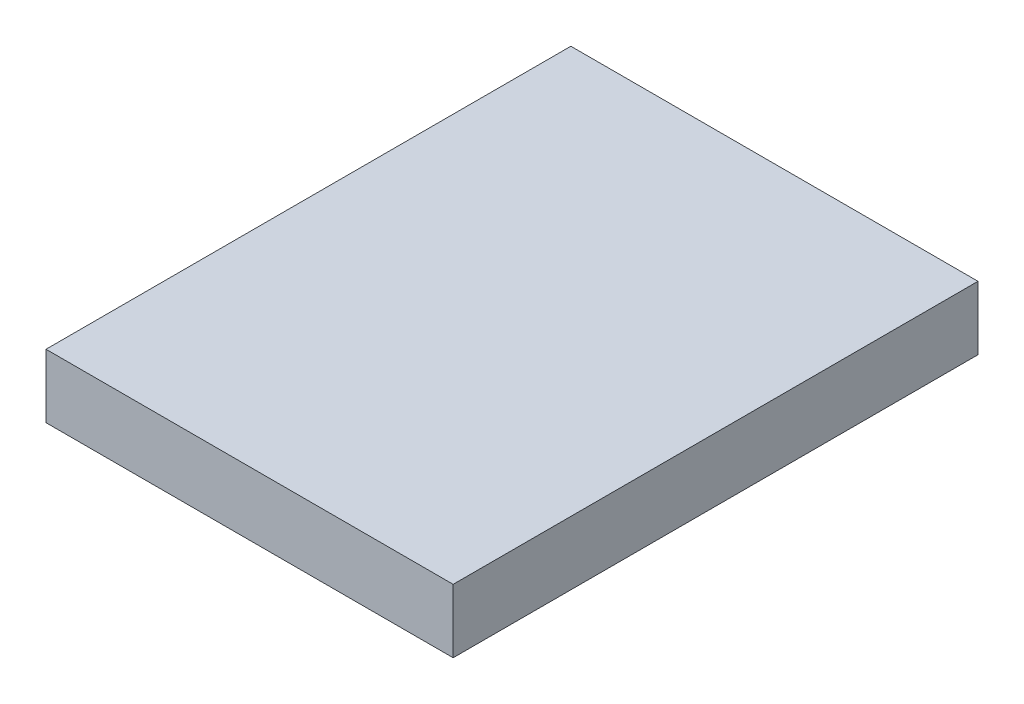
ISO-10303-21;
HEADER;
FILE_DESCRIPTION(('STEP AP214'),'2;1');
FILE_NAME('part.step','',(''),(''),'','','');
FILE_SCHEMA(('AUTOMOTIVE_DESIGN { 1 0 10303 214 1 1 1 1 }'));
ENDSEC;
DATA;
#1=APPLICATION_CONTEXT('core data for automotive mechanical design processes');
#2=APPLICATION_PROTOCOL_DEFINITION('international standard','automotive_design',2000,#1);
#3=PRODUCT_CONTEXT('',#1,'mechanical');
#4=PRODUCT('Part','Part','',(#3));
#5=PRODUCT_RELATED_PRODUCT_CATEGORY('part','',(#4));
#6=PRODUCT_DEFINITION_FORMATION('','',#4);
#7=PRODUCT_DEFINITION_CONTEXT('part definition',#1,'design');
#8=PRODUCT_DEFINITION('design','',#6,#7);
#9=PRODUCT_DEFINITION_SHAPE('','',#8);
#10=(LENGTH_UNIT() NAMED_UNIT(*) SI_UNIT(.MILLI.,.METRE.));
#11=(NAMED_UNIT(*) PLANE_ANGLE_UNIT() SI_UNIT($,.RADIAN.));
#12=(NAMED_UNIT(*) SI_UNIT($,.STERADIAN.) SOLID_ANGLE_UNIT());
#13=UNCERTAINTY_MEASURE_WITH_UNIT(LENGTH_MEASURE(1.E-05),#10,'distance_accuracy_value','');
#14=(GEOMETRIC_REPRESENTATION_CONTEXT(3) GLOBAL_UNCERTAINTY_ASSIGNED_CONTEXT((#13)) GLOBAL_UNIT_ASSIGNED_CONTEXT((#10,
#11,#12)) REPRESENTATION_CONTEXT('',''));
#15=CARTESIAN_POINT('',(0.,0.,0.));
#16=DIRECTION('',(0.,0.,1.));
#17=DIRECTION('',(1.,0.,0.));
#18=AXIS2_PLACEMENT_3D('',#15,#16,#17);
#19=CARTESIAN_POINT('',(-17.2667357512953,5.08,-7.79108808290155));
#20=DIRECTION('',(1.,0.,0.));
#21=DIRECTION('',(0.,0.,-1.));
#22=AXIS2_PLACEMENT_3D('',#19,#20,#21);
#23=PLANE('',#22);
#24=DIRECTION('',(0.,0.,1.));
#25=VECTOR('',#24,1.);
#26=CARTESIAN_POINT('',(-17.2667357512953,0.,-7.79108808290155));
#27=LINE('',#26,#25);
#28=CARTESIAN_POINT('',(-17.2667357512953,0.,-7.79108808290155));
#29=VERTEX_POINT('',#28);
#30=CARTESIAN_POINT('',(-17.2667357512953,0.,34.1189119170984));
#31=VERTEX_POINT('',#30);
#32=EDGE_CURVE('E109',#29,#31,#27,.T.);
#33=ORIENTED_EDGE('',*,*,#32,.T.);
#34=DIRECTION('',(0.,-1.,0.));
#35=VECTOR('',#34,1.);
#36=CARTESIAN_POINT('',(-17.2667357512953,5.08,34.1189119170984));
#37=LINE('',#36,#35);
#38=CARTESIAN_POINT('',(-17.2667357512953,5.08,34.1189119170984));
#39=VERTEX_POINT('',#38);
#40=EDGE_CURVE('E11',#39,#31,#37,.T.);
#41=ORIENTED_EDGE('',*,*,#40,.F.);
#42=DIRECTION('',(0.,0.,1.));
#43=VECTOR('',#42,1.);
#44=CARTESIAN_POINT('',(-17.2667357512953,5.08,-7.79108808290155));
#45=LINE('',#44,#43);
#46=CARTESIAN_POINT('',(-17.2667357512953,5.08,-7.79108808290155));
#47=VERTEX_POINT('',#46);
#48=EDGE_CURVE('E110',#47,#39,#45,.T.);
#49=ORIENTED_EDGE('',*,*,#48,.F.);
#50=DIRECTION('',(0.,-1.,0.));
#51=VECTOR('',#50,1.);
#52=CARTESIAN_POINT('',(-17.2667357512953,5.08,-7.79108808290155));
#53=LINE('',#52,#51);
#54=EDGE_CURVE('E116',#47,#29,#53,.T.);
#55=ORIENTED_EDGE('',*,*,#54,.T.);
#56=EDGE_LOOP('',(#33,#41,#49,#55));
#57=FACE_BOUND('',#56,.T.);
#58=ADVANCED_FACE('F34',(#57),#23,.F.);
#59=CARTESIAN_POINT('',(-17.2667357512953,5.08,34.1189119170984));
#60=DIRECTION('',(0.,0.,-1.));
#61=DIRECTION('',(-1.,0.,0.));
#62=AXIS2_PLACEMENT_3D('',#59,#60,#61);
#63=PLANE('',#62);
#64=DIRECTION('',(1.,0.,0.));
#65=VECTOR('',#64,1.);
#66=CARTESIAN_POINT('',(-17.2667357512953,0.,34.1189119170984));
#67=LINE('',#66,#65);
#68=CARTESIAN_POINT('',(15.2452642487047,0.,34.1189119170984));
#69=VERTEX_POINT('',#68);
#70=EDGE_CURVE('E119',#31,#69,#67,.T.);
#71=ORIENTED_EDGE('',*,*,#70,.T.);
#72=DIRECTION('',(0.,-1.,0.));
#73=VECTOR('',#72,1.);
#74=CARTESIAN_POINT('',(15.2452642487047,5.08,34.1189119170984));
#75=LINE('',#74,#73);
#76=CARTESIAN_POINT('',(15.2452642487047,5.08,34.1189119170984));
#77=VERTEX_POINT('',#76);
#78=EDGE_CURVE('E42',#77,#69,#75,.T.);
#79=ORIENTED_EDGE('',*,*,#78,.F.);
#80=DIRECTION('',(1.,0.,0.));
#81=VECTOR('',#80,1.);
#82=CARTESIAN_POINT('',(-17.2667357512953,5.08,34.1189119170984));
#83=LINE('',#82,#81);
#84=EDGE_CURVE('E81',#39,#77,#83,.T.);
#85=ORIENTED_EDGE('',*,*,#84,.F.);
#86=ORIENTED_EDGE('',*,*,#40,.T.);
#87=EDGE_LOOP('',(#71,#79,#85,#86));
#88=FACE_BOUND('',#87,.T.);
#89=ADVANCED_FACE('F143',(#88),#63,.F.);
#90=CARTESIAN_POINT('',(15.2452642487047,5.08,-7.79108808290155));
#91=DIRECTION('',(-1.,0.,0.));
#92=DIRECTION('',(0.,0.,1.));
#93=AXIS2_PLACEMENT_3D('',#90,#91,#92);
#94=PLANE('',#93);
#95=DIRECTION('',(0.,0.,-1.));
#96=VECTOR('',#95,1.);
#97=CARTESIAN_POINT('',(15.2452642487047,0.,-7.79108808290155));
#98=LINE('',#97,#96);
#99=CARTESIAN_POINT('',(15.2452642487047,0.,-7.79108808290155));
#100=VERTEX_POINT('',#99);
#101=EDGE_CURVE('E68',#69,#100,#98,.T.);
#102=ORIENTED_EDGE('',*,*,#101,.T.);
#103=DIRECTION('',(0.,-1.,0.));
#104=VECTOR('',#103,1.);
#105=CARTESIAN_POINT('',(15.2452642487047,5.08,-7.79108808290155));
#106=LINE('',#105,#104);
#107=CARTESIAN_POINT('',(15.2452642487047,5.08,-7.79108808290155));
#108=VERTEX_POINT('',#107);
#109=EDGE_CURVE('E124',#108,#100,#106,.T.);
#110=ORIENTED_EDGE('',*,*,#109,.F.);
#111=DIRECTION('',(0.,0.,-1.));
#112=VECTOR('',#111,1.);
#113=CARTESIAN_POINT('',(15.2452642487047,5.08,-7.79108808290155));
#114=LINE('',#113,#112);
#115=EDGE_CURVE('E113',#77,#108,#114,.T.);
#116=ORIENTED_EDGE('',*,*,#115,.F.);
#117=ORIENTED_EDGE('',*,*,#78,.T.);
#118=EDGE_LOOP('',(#102,#110,#116,#117));
#119=FACE_BOUND('',#118,.T.);
#120=ADVANCED_FACE('F126',(#119),#94,.F.);
#121=CARTESIAN_POINT('',(-17.2667357512953,5.08,-7.79108808290155));
#122=DIRECTION('',(0.,0.,1.));
#123=DIRECTION('',(1.,0.,0.));
#124=AXIS2_PLACEMENT_3D('',#121,#122,#123);
#125=PLANE('',#124);
#126=CARTESIAN_POINT('',(-12.1867357512953,2.71835312290647,-7.79108808290155));
#127=DIRECTION('',(0.,0.,-1.));
#128=DIRECTION('',(-1.,0.,0.));
#129=AXIS2_PLACEMENT_3D('',#126,#127,#128);
#130=CIRCLE('',#129,1.18744999999999);
#131=CARTESIAN_POINT('',(-13.3741857512953,2.71835312290647,-7.79108808290155));
#132=VERTEX_POINT('',#131);
#133=EDGE_CURVE('E99',#132,#132,#130,.T.);
#134=ORIENTED_EDGE('',*,*,#133,.F.);
#135=EDGE_LOOP('',(#134));
#136=FACE_BOUND('',#135,.T.);
#137=CARTESIAN_POINT('',(10.6732642487047,2.71835312290647,-7.79108808290155));
#138=DIRECTION('',(0.,0.,-1.));
#139=DIRECTION('',(-1.,0.,0.));
#140=AXIS2_PLACEMENT_3D('',#137,#138,#139);
#141=CIRCLE('',#140,1.18744999999999);
#142=CARTESIAN_POINT('',(9.48581424870467,2.71835312290647,-7.79108808290155));
#143=VERTEX_POINT('',#142);
#144=EDGE_CURVE('E98',#143,#143,#141,.T.);
#145=ORIENTED_EDGE('',*,*,#144,.F.);
#146=EDGE_LOOP('',(#145));
#147=FACE_BOUND('',#146,.T.);
#148=DIRECTION('',(-1.,0.,0.));
#149=VECTOR('',#148,1.);
#150=CARTESIAN_POINT('',(-17.2667357512953,0.,-7.79108808290155));
#151=LINE('',#150,#149);
#152=EDGE_CURVE('E74',#100,#29,#151,.T.);
#153=ORIENTED_EDGE('',*,*,#152,.T.);
#154=ORIENTED_EDGE('',*,*,#54,.F.);
#155=DIRECTION('',(-1.,0.,0.));
#156=VECTOR('',#155,1.);
#157=CARTESIAN_POINT('',(-17.2667357512953,5.08,-7.79108808290155));
#158=LINE('',#157,#156);
#159=EDGE_CURVE('E50',#108,#47,#158,.T.);
#160=ORIENTED_EDGE('',*,*,#159,.F.);
#161=ORIENTED_EDGE('',*,*,#109,.T.);
#162=EDGE_LOOP('',(#153,#154,#160,#161));
#163=FACE_BOUND('',#162,.T.);
#164=ADVANCED_FACE('F133',(#136,#147,#163),#125,.F.);
#165=CARTESIAN_POINT('',(0.,5.08,0.));
#166=DIRECTION('',(0.,1.,0.));
#167=DIRECTION('',(0.,0.,1.));
#168=AXIS2_PLACEMENT_3D('',#165,#166,#167);
#169=PLANE('',#168);
#170=ORIENTED_EDGE('',*,*,#48,.T.);
#171=ORIENTED_EDGE('',*,*,#84,.T.);
#172=ORIENTED_EDGE('',*,*,#115,.T.);
#173=ORIENTED_EDGE('',*,*,#159,.T.);
#174=EDGE_LOOP('',(#170,#171,#172,#173));
#175=FACE_BOUND('',#174,.T.);
#176=ADVANCED_FACE('F135',(#175),#169,.T.);
#177=CARTESIAN_POINT('',(0.,0.,0.));
#178=DIRECTION('',(0.,1.,0.));
#179=DIRECTION('',(0.,0.,1.));
#180=AXIS2_PLACEMENT_3D('',#177,#178,#179);
#181=PLANE('',#180);
#182=ORIENTED_EDGE('',*,*,#32,.F.);
#183=ORIENTED_EDGE('',*,*,#152,.F.);
#184=ORIENTED_EDGE('',*,*,#101,.F.);
#185=ORIENTED_EDGE('',*,*,#70,.F.);
#186=EDGE_LOOP('',(#182,#183,#184,#185));
#187=FACE_BOUND('',#186,.T.);
#188=ADVANCED_FACE('F129',(#187),#181,.F.);
#189=CARTESIAN_POINT('',(10.6732642487047,2.71835312290647,2.36891191709845));
#190=DIRECTION('',(0.,0.,-1.));
#191=DIRECTION('',(-1.,0.,0.));
#192=AXIS2_PLACEMENT_3D('',#189,#190,#191);
#193=CONICAL_SURFACE('',#192,1.18744999999999,1.02974425867665);
#194=CARTESIAN_POINT('',(10.6732642487047,2.71835312290647,3.08240385916272));
#195=VERTEX_POINT('',#194);
#196=VERTEX_LOOP('',#195);
#197=FACE_BOUND('',#196,.T.);
#198=CARTESIAN_POINT('',(10.6732642487047,2.71835312290647,2.36891191709845));
#199=DIRECTION('',(0.,0.,-1.));
#200=DIRECTION('',(-1.,0.,0.));
#201=AXIS2_PLACEMENT_3D('',#198,#199,#200);
#202=CIRCLE('',#201,1.18744999999999);
#203=CARTESIAN_POINT('',(9.48581424870468,2.71835312290647,2.36891191709845));
#204=VERTEX_POINT('',#203);
#205=EDGE_CURVE('E102',#204,#204,#202,.T.);
#206=ORIENTED_EDGE('',*,*,#205,.T.);
#207=EDGE_LOOP('',(#206));
#208=FACE_BOUND('',#207,.T.);
#209=ADVANCED_FACE('F173',(#197,#208),#193,.F.);
#210=CARTESIAN_POINT('',(10.6732642487047,2.71835312290647,-7.79108808290155));
#211=DIRECTION('',(0.,0.,-1.));
#212=DIRECTION('',(-1.,0.,0.));
#213=AXIS2_PLACEMENT_3D('',#210,#211,#212);
#214=CYLINDRICAL_SURFACE('',#213,1.18744999999999);
#215=ORIENTED_EDGE('',*,*,#205,.F.);
#216=EDGE_LOOP('',(#215));
#217=FACE_BOUND('',#216,.T.);
#218=ORIENTED_EDGE('',*,*,#144,.T.);
#219=EDGE_LOOP('',(#218));
#220=FACE_BOUND('',#219,.T.);
#221=ADVANCED_FACE('F92',(#217,#220),#214,.F.);
#222=CARTESIAN_POINT('',(-12.1867357512953,2.71835312290647,2.36891191709845));
#223=DIRECTION('',(0.,0.,-1.));
#224=DIRECTION('',(-1.,0.,0.));
#225=AXIS2_PLACEMENT_3D('',#222,#223,#224);
#226=CONICAL_SURFACE('',#225,1.18744999999999,1.02974425867665);
#227=CARTESIAN_POINT('',(-12.1867357512953,2.71835312290647,3.08240385916272));
#228=VERTEX_POINT('',#227);
#229=VERTEX_LOOP('',#228);
#230=FACE_BOUND('',#229,.T.);
#231=CARTESIAN_POINT('',(-12.1867357512953,2.71835312290647,2.36891191709845));
#232=DIRECTION('',(0.,0.,-1.));
#233=DIRECTION('',(-1.,0.,0.));
#234=AXIS2_PLACEMENT_3D('',#231,#232,#233);
#235=CIRCLE('',#234,1.18744999999999);
#236=CARTESIAN_POINT('',(-13.3741857512953,2.71835312290647,2.36891191709845));
#237=VERTEX_POINT('',#236);
#238=EDGE_CURVE('E96',#237,#237,#235,.T.);
#239=ORIENTED_EDGE('',*,*,#238,.T.);
#240=EDGE_LOOP('',(#239));
#241=FACE_BOUND('',#240,.T.);
#242=ADVANCED_FACE('F88',(#230,#241),#226,.F.);
#243=CARTESIAN_POINT('',(-12.1867357512953,2.71835312290647,-7.79108808290155));
#244=DIRECTION('',(0.,0.,-1.));
#245=DIRECTION('',(-1.,0.,0.));
#246=AXIS2_PLACEMENT_3D('',#243,#244,#245);
#247=CYLINDRICAL_SURFACE('',#246,1.18744999999999);
#248=ORIENTED_EDGE('',*,*,#238,.F.);
#249=EDGE_LOOP('',(#248));
#250=FACE_BOUND('',#249,.T.);
#251=ORIENTED_EDGE('',*,*,#133,.T.);
#252=EDGE_LOOP('',(#251));
#253=FACE_BOUND('',#252,.T.);
#254=ADVANCED_FACE('F91',(#250,#253),#247,.F.);
#255=CLOSED_SHELL('',(#58,#89,#120,#164,#176,#188,#209,#221,#242,#254));
#256=MANIFOLD_SOLID_BREP('B2',#255);
#257=ADVANCED_BREP_SHAPE_REPRESENTATION('',(#18,#256),#14);
#258=SHAPE_DEFINITION_REPRESENTATION(#9,#257);
ENDSEC;
END-ISO-10303-21;
